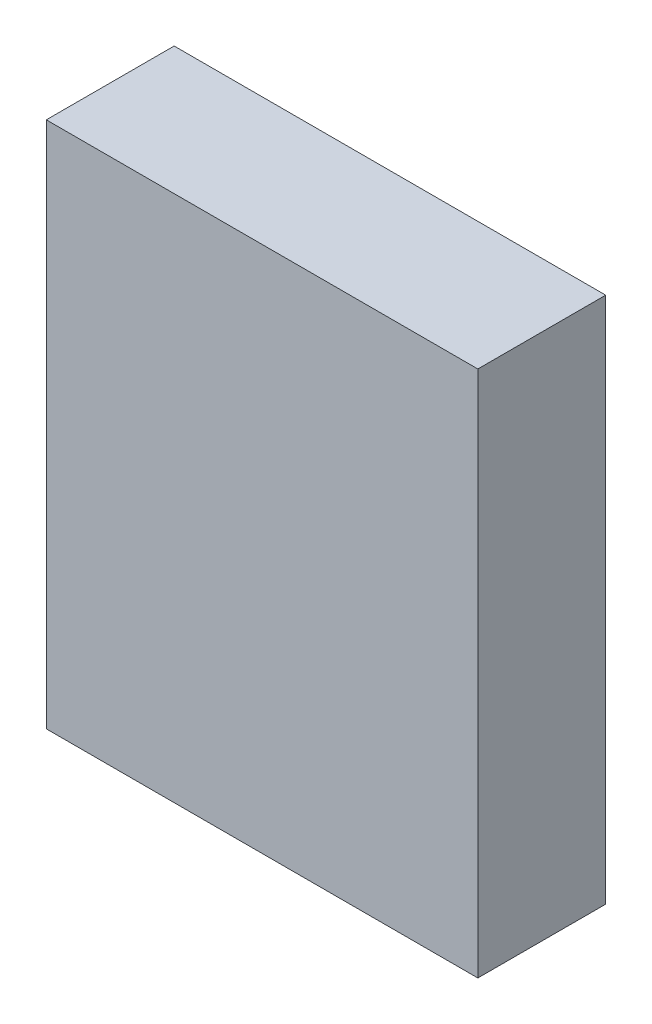
ISO-10303-21;
HEADER;
FILE_DESCRIPTION(('STEP AP214'),'2;1');
FILE_NAME('part.step','',(''),(''),'','','');
FILE_SCHEMA(('AUTOMOTIVE_DESIGN { 1 0 10303 214 1 1 1 1 }'));
ENDSEC;
DATA;
#1=APPLICATION_CONTEXT('core data for automotive mechanical design processes');
#2=APPLICATION_PROTOCOL_DEFINITION('international standard','automotive_design',2000,#1);
#3=PRODUCT_CONTEXT('',#1,'mechanical');
#4=PRODUCT('Part','Part','',(#3));
#5=PRODUCT_RELATED_PRODUCT_CATEGORY('part','',(#4));
#6=PRODUCT_DEFINITION_FORMATION('','',#4);
#7=PRODUCT_DEFINITION_CONTEXT('part definition',#1,'design');
#8=PRODUCT_DEFINITION('design','',#6,#7);
#9=PRODUCT_DEFINITION_SHAPE('','',#8);
#10=(LENGTH_UNIT() NAMED_UNIT(*) SI_UNIT(.MILLI.,.METRE.));
#11=(NAMED_UNIT(*) PLANE_ANGLE_UNIT() SI_UNIT($,.RADIAN.));
#12=(NAMED_UNIT(*) SI_UNIT($,.STERADIAN.) SOLID_ANGLE_UNIT());
#13=UNCERTAINTY_MEASURE_WITH_UNIT(LENGTH_MEASURE(1.E-05),#10,'distance_accuracy_value','');
#14=(GEOMETRIC_REPRESENTATION_CONTEXT(3) GLOBAL_UNCERTAINTY_ASSIGNED_CONTEXT((#13)) GLOBAL_UNIT_ASSIGNED_CONTEXT((#10,
#11,#12)) REPRESENTATION_CONTEXT('',''));
#15=CARTESIAN_POINT('',(0.,0.,0.));
#16=DIRECTION('',(0.,0.,1.));
#17=DIRECTION('',(1.,0.,0.));
#18=AXIS2_PLACEMENT_3D('',#15,#16,#17);
#19=CARTESIAN_POINT('',(0.,0.,0.2));
#20=DIRECTION('',(0.,0.,1.));
#21=DIRECTION('',(1.,0.,0.));
#22=AXIS2_PLACEMENT_3D('',#19,#20,#21);
#23=PLANE('',#22);
#24=DIRECTION('',(0.,1.,0.));
#25=VECTOR('',#24,1.);
#26=CARTESIAN_POINT('',(0.675,0.,0.2));
#27=LINE('',#26,#25);
#28=CARTESIAN_POINT('',(0.675,0.825,0.2));
#29=VERTEX_POINT('',#28);
#30=CARTESIAN_POINT('',(0.675,0.,0.2));
#31=VERTEX_POINT('',#30);
#32=EDGE_CURVE('E76',#29,#31,#27,.F.);
#33=ORIENTED_EDGE('',*,*,#32,.F.);
#34=DIRECTION('',(1.,0.,0.));
#35=VECTOR('',#34,1.);
#36=CARTESIAN_POINT('',(0.,0.825,0.2));
#37=LINE('',#36,#35);
#38=CARTESIAN_POINT('',(0.,0.825,0.2));
#39=VERTEX_POINT('',#38);
#40=EDGE_CURVE('E58',#39,#29,#37,.T.);
#41=ORIENTED_EDGE('',*,*,#40,.F.);
#42=DIRECTION('',(0.,1.,0.));
#43=VECTOR('',#42,1.);
#44=CARTESIAN_POINT('',(0.,0.,0.2));
#45=LINE('',#44,#43);
#46=CARTESIAN_POINT('',(0.,0.,0.2));
#47=VERTEX_POINT('',#46);
#48=EDGE_CURVE('E20',#39,#47,#45,.F.);
#49=ORIENTED_EDGE('',*,*,#48,.T.);
#50=DIRECTION('',(1.,0.,0.));
#51=VECTOR('',#50,1.);
#52=CARTESIAN_POINT('',(0.,0.,0.2));
#53=LINE('',#52,#51);
#54=EDGE_CURVE('E55',#47,#31,#53,.T.);
#55=ORIENTED_EDGE('',*,*,#54,.T.);
#56=EDGE_LOOP('',(#33,#41,#49,#55));
#57=FACE_BOUND('',#56,.T.);
#58=ADVANCED_FACE('F17',(#57),#23,.T.);
#59=CARTESIAN_POINT('',(0.,0.,0.));
#60=DIRECTION('',(1.,0.,0.));
#61=DIRECTION('',(0.,0.,-1.));
#62=AXIS2_PLACEMENT_3D('',#59,#60,#61);
#63=PLANE('',#62);
#64=DIRECTION('',(0.,0.,1.));
#65=VECTOR('',#64,1.);
#66=CARTESIAN_POINT('',(0.,0.825,0.));
#67=LINE('',#66,#65);
#68=CARTESIAN_POINT('',(0.,0.825,0.));
#69=VERTEX_POINT('',#68);
#70=EDGE_CURVE('E78',#69,#39,#67,.T.);
#71=ORIENTED_EDGE('',*,*,#70,.F.);
#72=DIRECTION('',(0.,1.,0.));
#73=VECTOR('',#72,1.);
#74=CARTESIAN_POINT('',(0.,0.,0.));
#75=LINE('',#74,#73);
#76=CARTESIAN_POINT('',(0.,0.,0.));
#77=VERTEX_POINT('',#76);
#78=EDGE_CURVE('E73',#69,#77,#75,.F.);
#79=ORIENTED_EDGE('',*,*,#78,.T.);
#80=DIRECTION('',(0.,0.,1.));
#81=VECTOR('',#80,1.);
#82=CARTESIAN_POINT('',(0.,0.,0.));
#83=LINE('',#82,#81);
#84=EDGE_CURVE('E63',#77,#47,#83,.T.);
#85=ORIENTED_EDGE('',*,*,#84,.T.);
#86=ORIENTED_EDGE('',*,*,#48,.F.);
#87=EDGE_LOOP('',(#71,#79,#85,#86));
#88=FACE_BOUND('',#87,.T.);
#89=ADVANCED_FACE('F72',(#88),#63,.F.);
#90=CARTESIAN_POINT('',(0.,0.,0.));
#91=DIRECTION('',(0.,1.,0.));
#92=DIRECTION('',(0.,0.,1.));
#93=AXIS2_PLACEMENT_3D('',#90,#91,#92);
#94=PLANE('',#93);
#95=ORIENTED_EDGE('',*,*,#54,.F.);
#96=ORIENTED_EDGE('',*,*,#84,.F.);
#97=DIRECTION('',(1.,0.,0.));
#98=VECTOR('',#97,1.);
#99=CARTESIAN_POINT('',(0.,0.,0.));
#100=LINE('',#99,#98);
#101=CARTESIAN_POINT('',(0.675,0.,0.));
#102=VERTEX_POINT('',#101);
#103=EDGE_CURVE('E83',#77,#102,#100,.T.);
#104=ORIENTED_EDGE('',*,*,#103,.T.);
#105=DIRECTION('',(0.,0.,-1.));
#106=VECTOR('',#105,1.);
#107=CARTESIAN_POINT('',(0.675,0.,0.));
#108=LINE('',#107,#106);
#109=EDGE_CURVE('E69',#31,#102,#108,.T.);
#110=ORIENTED_EDGE('',*,*,#109,.F.);
#111=EDGE_LOOP('',(#95,#96,#104,#110));
#112=FACE_BOUND('',#111,.T.);
#113=ADVANCED_FACE('F66',(#112),#94,.F.);
#114=CARTESIAN_POINT('',(0.675,0.,0.));
#115=DIRECTION('',(1.,0.,0.));
#116=DIRECTION('',(0.,0.,-1.));
#117=AXIS2_PLACEMENT_3D('',#114,#115,#116);
#118=PLANE('',#117);
#119=DIRECTION('',(0.,0.,1.));
#120=VECTOR('',#119,1.);
#121=CARTESIAN_POINT('',(0.675,0.825,0.));
#122=LINE('',#121,#120);
#123=CARTESIAN_POINT('',(0.675,0.825,0.));
#124=VERTEX_POINT('',#123);
#125=EDGE_CURVE('E34',#29,#124,#122,.F.);
#126=ORIENTED_EDGE('',*,*,#125,.F.);
#127=ORIENTED_EDGE('',*,*,#32,.T.);
#128=ORIENTED_EDGE('',*,*,#109,.T.);
#129=DIRECTION('',(0.,1.,0.));
#130=VECTOR('',#129,1.);
#131=CARTESIAN_POINT('',(0.675,0.,0.));
#132=LINE('',#131,#130);
#133=EDGE_CURVE('E26',#102,#124,#132,.T.);
#134=ORIENTED_EDGE('',*,*,#133,.T.);
#135=EDGE_LOOP('',(#126,#127,#128,#134));
#136=FACE_BOUND('',#135,.T.);
#137=ADVANCED_FACE('F88',(#136),#118,.T.);
#138=CARTESIAN_POINT('',(0.,0.825,0.));
#139=DIRECTION('',(0.,1.,0.));
#140=DIRECTION('',(0.,0.,1.));
#141=AXIS2_PLACEMENT_3D('',#138,#139,#140);
#142=PLANE('',#141);
#143=ORIENTED_EDGE('',*,*,#40,.T.);
#144=ORIENTED_EDGE('',*,*,#125,.T.);
#145=DIRECTION('',(1.,0.,0.));
#146=VECTOR('',#145,1.);
#147=CARTESIAN_POINT('',(0.,0.825,0.));
#148=LINE('',#147,#146);
#149=EDGE_CURVE('E11',#124,#69,#148,.F.);
#150=ORIENTED_EDGE('',*,*,#149,.T.);
#151=ORIENTED_EDGE('',*,*,#70,.T.);
#152=EDGE_LOOP('',(#143,#144,#150,#151));
#153=FACE_BOUND('',#152,.T.);
#154=ADVANCED_FACE('F91',(#153),#142,.T.);
#155=CARTESIAN_POINT('',(0.,0.,0.));
#156=DIRECTION('',(0.,0.,1.));
#157=DIRECTION('',(1.,0.,0.));
#158=AXIS2_PLACEMENT_3D('',#155,#156,#157);
#159=PLANE('',#158);
#160=ORIENTED_EDGE('',*,*,#133,.F.);
#161=ORIENTED_EDGE('',*,*,#103,.F.);
#162=ORIENTED_EDGE('',*,*,#78,.F.);
#163=ORIENTED_EDGE('',*,*,#149,.F.);
#164=EDGE_LOOP('',(#160,#161,#162,#163));
#165=FACE_BOUND('',#164,.T.);
#166=ADVANCED_FACE('F90',(#165),#159,.F.);
#167=CLOSED_SHELL('',(#58,#89,#113,#137,#154,#166));
#168=MANIFOLD_SOLID_BREP('B1',#167);
#169=ADVANCED_BREP_SHAPE_REPRESENTATION('',(#18,#168),#14);
#170=SHAPE_DEFINITION_REPRESENTATION(#9,#169);
ENDSEC;
END-ISO-10303-21;
